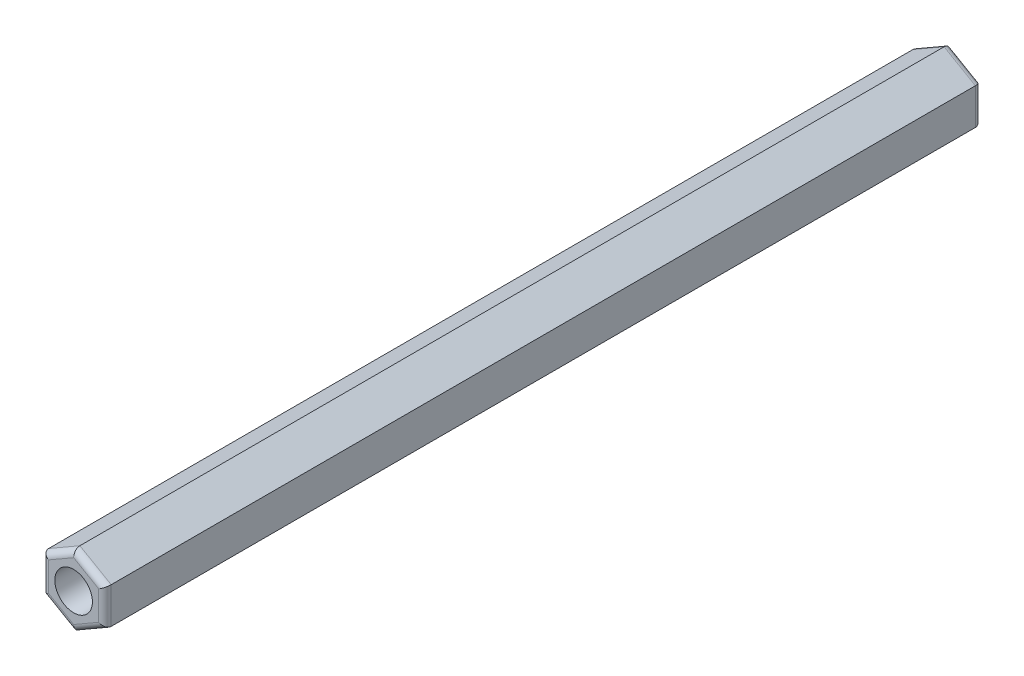
ISO-10303-21;
HEADER;
FILE_DESCRIPTION(('STEP AP214'),'2;1');
FILE_NAME('part.step','',(''),(''),'','','');
FILE_SCHEMA(('AUTOMOTIVE_DESIGN { 1 0 10303 214 1 1 1 1 }'));
ENDSEC;
DATA;
#1=APPLICATION_CONTEXT('core data for automotive mechanical design processes');
#2=APPLICATION_PROTOCOL_DEFINITION('international standard','automotive_design',2000,#1);
#3=PRODUCT_CONTEXT('',#1,'mechanical');
#4=PRODUCT('Part','Part','',(#3));
#5=PRODUCT_RELATED_PRODUCT_CATEGORY('part','',(#4));
#6=PRODUCT_DEFINITION_FORMATION('','',#4);
#7=PRODUCT_DEFINITION_CONTEXT('part definition',#1,'design');
#8=PRODUCT_DEFINITION('design','',#6,#7);
#9=PRODUCT_DEFINITION_SHAPE('','',#8);
#10=(LENGTH_UNIT() NAMED_UNIT(*) SI_UNIT(.MILLI.,.METRE.));
#11=(NAMED_UNIT(*) PLANE_ANGLE_UNIT() SI_UNIT($,.RADIAN.));
#12=(NAMED_UNIT(*) SI_UNIT($,.STERADIAN.) SOLID_ANGLE_UNIT());
#13=UNCERTAINTY_MEASURE_WITH_UNIT(LENGTH_MEASURE(1.E-05),#10,'distance_accuracy_value','');
#14=(GEOMETRIC_REPRESENTATION_CONTEXT(3) GLOBAL_UNCERTAINTY_ASSIGNED_CONTEXT((#13)) GLOBAL_UNIT_ASSIGNED_CONTEXT((#10,
#11,#12)) REPRESENTATION_CONTEXT('',''));
#15=CARTESIAN_POINT('',(0.,0.,0.));
#16=DIRECTION('',(0.,0.,1.));
#17=DIRECTION('',(1.,0.,0.));
#18=AXIS2_PLACEMENT_3D('',#15,#16,#17);
#19=CARTESIAN_POINT('',(-67.50212267549,1.44337567297406,70.));
#20=DIRECTION('',(1.,0.,0.));
#21=DIRECTION('',(0.,0.,-1.));
#22=AXIS2_PLACEMENT_3D('',#19,#20,#21);
#23=PLANE('',#22);
#24=DIRECTION('',(0.,0.,-1.));
#25=VECTOR('',#24,1.);
#26=CARTESIAN_POINT('',(-67.50212267549,-1.44337567297407,70.));
#27=LINE('',#26,#25);
#28=CARTESIAN_POINT('',(-67.50212267549,-1.44337567297407,69.5));
#29=VERTEX_POINT('',#28);
#30=CARTESIAN_POINT('',(-67.50212267549,-1.44337567297407,0.5));
#31=VERTEX_POINT('',#30);
#32=EDGE_CURVE('E153',#29,#31,#27,.T.);
#33=ORIENTED_EDGE('',*,*,#32,.T.);
#34=DIRECTION('',(0.,-1.,0.));
#35=VECTOR('',#34,1.);
#36=CARTESIAN_POINT('',(-67.50212267549,1.44337567297406,0.5));
#37=LINE('',#36,#35);
#38=CARTESIAN_POINT('',(-67.50212267549,1.44337567297406,0.5));
#39=VERTEX_POINT('',#38);
#40=EDGE_CURVE('E150',#31,#39,#37,.F.);
#41=ORIENTED_EDGE('',*,*,#40,.T.);
#42=DIRECTION('',(0.,0.,-1.));
#43=VECTOR('',#42,1.);
#44=CARTESIAN_POINT('',(-67.50212267549,1.44337567297406,70.));
#45=LINE('',#44,#43);
#46=CARTESIAN_POINT('',(-67.50212267549,1.44337567297406,69.5));
#47=VERTEX_POINT('',#46);
#48=EDGE_CURVE('E147',#47,#39,#45,.T.);
#49=ORIENTED_EDGE('',*,*,#48,.F.);
#50=DIRECTION('',(0.,-1.,0.));
#51=VECTOR('',#50,1.);
#52=CARTESIAN_POINT('',(-67.50212267549,-1.44337567297407,69.5));
#53=LINE('',#52,#51);
#54=EDGE_CURVE('E207',#47,#29,#53,.T.);
#55=ORIENTED_EDGE('',*,*,#54,.T.);
#56=EDGE_LOOP('',(#33,#41,#49,#55));
#57=FACE_BOUND('',#56,.T.);
#58=ADVANCED_FACE('F33',(#57),#23,.T.);
#59=CARTESIAN_POINT('',(-70.00212267549,2.88675134594811,70.));
#60=DIRECTION('',(0.5,0.866025403784439,0.));
#61=DIRECTION('',(-0.866025403784439,0.5,0.));
#62=AXIS2_PLACEMENT_3D('',#59,#60,#61);
#63=PLANE('',#62);
#64=ORIENTED_EDGE('',*,*,#48,.T.);
#65=DIRECTION('',(0.866025403784439,-0.5,0.));
#66=VECTOR('',#65,1.);
#67=CARTESIAN_POINT('',(-70.00212267549,2.88675134594811,0.5));
#68=LINE('',#67,#66);
#69=CARTESIAN_POINT('',(-70.00212267549,2.88675134594811,0.5));
#70=VERTEX_POINT('',#69);
#71=EDGE_CURVE('E192',#39,#70,#68,.F.);
#72=ORIENTED_EDGE('',*,*,#71,.T.);
#73=DIRECTION('',(0.,0.,-1.));
#74=VECTOR('',#73,1.);
#75=CARTESIAN_POINT('',(-70.00212267549,2.88675134594811,70.));
#76=LINE('',#75,#74);
#77=CARTESIAN_POINT('',(-70.00212267549,2.88675134594811,69.5));
#78=VERTEX_POINT('',#77);
#79=EDGE_CURVE('E256',#78,#70,#76,.T.);
#80=ORIENTED_EDGE('',*,*,#79,.F.);
#81=DIRECTION('',(0.866025403784439,-0.5,0.));
#82=VECTOR('',#81,1.);
#83=CARTESIAN_POINT('',(-67.50212267549,1.44337567297406,69.5));
#84=LINE('',#83,#82);
#85=EDGE_CURVE('E198',#78,#47,#84,.T.);
#86=ORIENTED_EDGE('',*,*,#85,.T.);
#87=EDGE_LOOP('',(#64,#72,#80,#86));
#88=FACE_BOUND('',#87,.T.);
#89=ADVANCED_FACE('F285',(#88),#63,.T.);
#90=CARTESIAN_POINT('',(-72.50212267549,1.44337567297405,70.));
#91=DIRECTION('',(-0.5,0.866025403784438,0.));
#92=DIRECTION('',(-0.866025403784439,-0.5,0.));
#93=AXIS2_PLACEMENT_3D('',#90,#91,#92);
#94=PLANE('',#93);
#95=ORIENTED_EDGE('',*,*,#79,.T.);
#96=DIRECTION('',(0.866025403784439,0.5,0.));
#97=VECTOR('',#96,1.);
#98=CARTESIAN_POINT('',(-72.50212267549,1.44337567297405,0.5));
#99=LINE('',#98,#97);
#100=CARTESIAN_POINT('',(-72.50212267549,1.44337567297405,0.5));
#101=VERTEX_POINT('',#100);
#102=EDGE_CURVE('E232',#70,#101,#99,.F.);
#103=ORIENTED_EDGE('',*,*,#102,.T.);
#104=DIRECTION('',(0.,0.,-1.));
#105=VECTOR('',#104,1.);
#106=CARTESIAN_POINT('',(-72.50212267549,1.44337567297405,70.));
#107=LINE('',#106,#105);
#108=CARTESIAN_POINT('',(-72.50212267549,1.44337567297405,69.5));
#109=VERTEX_POINT('',#108);
#110=EDGE_CURVE('E254',#109,#101,#107,.T.);
#111=ORIENTED_EDGE('',*,*,#110,.F.);
#112=DIRECTION('',(0.866025403784439,0.5,0.));
#113=VECTOR('',#112,1.);
#114=CARTESIAN_POINT('',(-70.00212267549,2.88675134594811,69.5));
#115=LINE('',#114,#113);
#116=EDGE_CURVE('E235',#109,#78,#115,.T.);
#117=ORIENTED_EDGE('',*,*,#116,.T.);
#118=EDGE_LOOP('',(#95,#103,#111,#117));
#119=FACE_BOUND('',#118,.T.);
#120=ADVANCED_FACE('F291',(#119),#94,.T.);
#121=CARTESIAN_POINT('',(-72.50212267549,-1.44337567297407,70.));
#122=DIRECTION('',(-1.,0.,0.));
#123=DIRECTION('',(0.,0.,1.));
#124=AXIS2_PLACEMENT_3D('',#121,#122,#123);
#125=PLANE('',#124);
#126=ORIENTED_EDGE('',*,*,#110,.T.);
#127=DIRECTION('',(0.,1.,0.));
#128=VECTOR('',#127,1.);
#129=CARTESIAN_POINT('',(-72.50212267549,-1.44337567297407,0.5));
#130=LINE('',#129,#128);
#131=CARTESIAN_POINT('',(-72.50212267549,-1.44337567297407,0.5));
#132=VERTEX_POINT('',#131);
#133=EDGE_CURVE('E202',#101,#132,#130,.F.);
#134=ORIENTED_EDGE('',*,*,#133,.T.);
#135=DIRECTION('',(0.,0.,-1.));
#136=VECTOR('',#135,1.);
#137=CARTESIAN_POINT('',(-72.50212267549,-1.44337567297407,70.));
#138=LINE('',#137,#136);
#139=CARTESIAN_POINT('',(-72.50212267549,-1.44337567297407,69.5));
#140=VERTEX_POINT('',#139);
#141=EDGE_CURVE('E251',#140,#132,#138,.T.);
#142=ORIENTED_EDGE('',*,*,#141,.F.);
#143=DIRECTION('',(0.,1.,0.));
#144=VECTOR('',#143,1.);
#145=CARTESIAN_POINT('',(-72.50212267549,1.44337567297405,69.5));
#146=LINE('',#145,#144);
#147=EDGE_CURVE('E227',#140,#109,#146,.T.);
#148=ORIENTED_EDGE('',*,*,#147,.T.);
#149=EDGE_LOOP('',(#126,#134,#142,#148));
#150=FACE_BOUND('',#149,.T.);
#151=ADVANCED_FACE('F342',(#150),#125,.T.);
#152=CARTESIAN_POINT('',(-70.00212267549,-2.88675134594813,70.));
#153=DIRECTION('',(-0.499999999999999,-0.866025403784439,0.));
#154=DIRECTION('',(0.866025403784439,-0.499999999999999,0.));
#155=AXIS2_PLACEMENT_3D('',#152,#153,#154);
#156=PLANE('',#155);
#157=ORIENTED_EDGE('',*,*,#141,.T.);
#158=DIRECTION('',(-0.866025403784439,0.499999999999999,0.));
#159=VECTOR('',#158,1.);
#160=CARTESIAN_POINT('',(-70.00212267549,-2.88675134594813,0.5));
#161=LINE('',#160,#159);
#162=CARTESIAN_POINT('',(-70.00212267549,-2.88675134594813,0.5));
#163=VERTEX_POINT('',#162);
#164=EDGE_CURVE('E200',#132,#163,#161,.F.);
#165=ORIENTED_EDGE('',*,*,#164,.T.);
#166=DIRECTION('',(0.,0.,-1.));
#167=VECTOR('',#166,1.);
#168=CARTESIAN_POINT('',(-70.00212267549,-2.88675134594813,70.));
#169=LINE('',#168,#167);
#170=CARTESIAN_POINT('',(-70.00212267549,-2.88675134594813,69.5));
#171=VERTEX_POINT('',#170);
#172=EDGE_CURVE('E248',#171,#163,#169,.T.);
#173=ORIENTED_EDGE('',*,*,#172,.F.);
#174=DIRECTION('',(-0.866025403784439,0.499999999999999,0.));
#175=VECTOR('',#174,1.);
#176=CARTESIAN_POINT('',(-72.50212267549,-1.44337567297407,69.5));
#177=LINE('',#176,#175);
#178=EDGE_CURVE('E197',#171,#140,#177,.T.);
#179=ORIENTED_EDGE('',*,*,#178,.T.);
#180=EDGE_LOOP('',(#157,#165,#173,#179));
#181=FACE_BOUND('',#180,.T.);
#182=ADVANCED_FACE('F281',(#181),#156,.T.);
#183=CARTESIAN_POINT('',(-67.50212267549,-1.44337567297407,70.));
#184=DIRECTION('',(0.500000000000001,-0.866025403784438,0.));
#185=DIRECTION('',(0.866025403784438,0.500000000000001,0.));
#186=AXIS2_PLACEMENT_3D('',#183,#184,#185);
#187=PLANE('',#186);
#188=ORIENTED_EDGE('',*,*,#172,.T.);
#189=DIRECTION('',(-0.866025403784438,-0.500000000000001,0.));
#190=VECTOR('',#189,1.);
#191=CARTESIAN_POINT('',(-67.50212267549,-1.44337567297407,0.5));
#192=LINE('',#191,#190);
#193=EDGE_CURVE('E212',#163,#31,#192,.F.);
#194=ORIENTED_EDGE('',*,*,#193,.T.);
#195=ORIENTED_EDGE('',*,*,#32,.F.);
#196=DIRECTION('',(-0.866025403784438,-0.500000000000001,0.));
#197=VECTOR('',#196,1.);
#198=CARTESIAN_POINT('',(-70.00212267549,-2.88675134594813,69.5));
#199=LINE('',#198,#197);
#200=EDGE_CURVE('E210',#29,#171,#199,.T.);
#201=ORIENTED_EDGE('',*,*,#200,.T.);
#202=EDGE_LOOP('',(#188,#194,#195,#201));
#203=FACE_BOUND('',#202,.T.);
#204=ADVANCED_FACE('F274',(#203),#187,.T.);
#205=CARTESIAN_POINT('',(0.,0.,70.));
#206=DIRECTION('',(0.,0.,-1.));
#207=DIRECTION('',(-1.,0.,0.));
#208=AXIS2_PLACEMENT_3D('',#205,#206,#207);
#209=PLANE('',#208);
#210=CARTESIAN_POINT('',(-70.00212267549,0.,70.));
#211=DIRECTION('',(0.,0.,1.));
#212=DIRECTION('',(1.,0.,0.));
#213=AXIS2_PLACEMENT_3D('',#210,#211,#212);
#214=CIRCLE('',#213,1.5);
#215=CARTESIAN_POINT('',(-68.50212267549,0.,70.));
#216=VERTEX_POINT('',#215);
#217=EDGE_CURVE('E259',#216,#216,#214,.T.);
#218=ORIENTED_EDGE('',*,*,#217,.F.);
#219=EDGE_LOOP('',(#218));
#220=FACE_BOUND('',#219,.T.);
#221=DIRECTION('',(0.866025403784439,-0.5,0.));
#222=VECTOR('',#221,1.);
#223=CARTESIAN_POINT('',(-70.25212267549,2.45373864405589,70.));
#224=LINE('',#223,#222);
#225=CARTESIAN_POINT('',(-68.00212267549,1.15470053837924,70.));
#226=VERTEX_POINT('',#225);
#227=CARTESIAN_POINT('',(-70.00212267549,2.30940107675849,70.));
#228=VERTEX_POINT('',#227);
#229=EDGE_CURVE('E57',#226,#228,#224,.F.);
#230=ORIENTED_EDGE('',*,*,#229,.T.);
#231=DIRECTION('',(0.866025403784439,0.5,0.));
#232=VECTOR('',#231,1.);
#233=CARTESIAN_POINT('',(-72.25212267549,1.01036297108183,70.));
#234=LINE('',#233,#232);
#235=CARTESIAN_POINT('',(-72.00212267549,1.15470053837923,70.));
#236=VERTEX_POINT('',#235);
#237=EDGE_CURVE('E11',#228,#236,#234,.F.);
#238=ORIENTED_EDGE('',*,*,#237,.T.);
#239=DIRECTION('',(0.,1.,0.));
#240=VECTOR('',#239,1.);
#241=CARTESIAN_POINT('',(-72.00212267549,-1.44337567297407,70.));
#242=LINE('',#241,#240);
#243=CARTESIAN_POINT('',(-72.00212267549,-1.15470053837925,70.));
#244=VERTEX_POINT('',#243);
#245=EDGE_CURVE('E42',#236,#244,#242,.F.);
#246=ORIENTED_EDGE('',*,*,#245,.T.);
#247=DIRECTION('',(-0.866025403784439,0.499999999999999,0.));
#248=VECTOR('',#247,1.);
#249=CARTESIAN_POINT('',(-69.75212267549,-2.45373864405591,70.));
#250=LINE('',#249,#248);
#251=CARTESIAN_POINT('',(-70.00212267549,-2.3094010767585,70.));
#252=VERTEX_POINT('',#251);
#253=EDGE_CURVE('E218',#244,#252,#250,.F.);
#254=ORIENTED_EDGE('',*,*,#253,.T.);
#255=DIRECTION('',(-0.866025403784438,-0.500000000000001,0.));
#256=VECTOR('',#255,1.);
#257=CARTESIAN_POINT('',(-67.75212267549,-1.01036297108185,70.));
#258=LINE('',#257,#256);
#259=CARTESIAN_POINT('',(-68.00212267549,-1.15470053837926,70.));
#260=VERTEX_POINT('',#259);
#261=EDGE_CURVE('E214',#252,#260,#258,.F.);
#262=ORIENTED_EDGE('',*,*,#261,.T.);
#263=DIRECTION('',(0.,-1.,0.));
#264=VECTOR('',#263,1.);
#265=CARTESIAN_POINT('',(-68.00212267549,1.44337567297406,70.));
#266=LINE('',#265,#264);
#267=EDGE_CURVE('E216',#260,#226,#266,.F.);
#268=ORIENTED_EDGE('',*,*,#267,.T.);
#269=EDGE_LOOP('',(#230,#238,#246,#254,#262,#268));
#270=FACE_BOUND('',#269,.T.);
#271=ADVANCED_FACE('F220',(#220,#270),#209,.F.);
#272=CARTESIAN_POINT('',(0.,0.,0.));
#273=DIRECTION('',(0.,0.,-1.));
#274=DIRECTION('',(-1.,0.,0.));
#275=AXIS2_PLACEMENT_3D('',#272,#273,#274);
#276=PLANE('',#275);
#277=CARTESIAN_POINT('',(-70.00212267549,0.,0.));
#278=DIRECTION('',(0.,0.,1.));
#279=DIRECTION('',(1.,0.,0.));
#280=AXIS2_PLACEMENT_3D('',#277,#278,#279);
#281=CIRCLE('',#280,1.5);
#282=CARTESIAN_POINT('',(-68.50212267549,0.,0.));
#283=VERTEX_POINT('',#282);
#284=EDGE_CURVE('E162',#283,#283,#281,.T.);
#285=ORIENTED_EDGE('',*,*,#284,.T.);
#286=EDGE_LOOP('',(#285));
#287=FACE_BOUND('',#286,.T.);
#288=DIRECTION('',(0.,1.,0.));
#289=VECTOR('',#288,1.);
#290=CARTESIAN_POINT('',(-72.00212267549,0.,0.));
#291=LINE('',#290,#289);
#292=CARTESIAN_POINT('',(-72.00212267549,-1.15470053837925,0.));
#293=VERTEX_POINT('',#292);
#294=CARTESIAN_POINT('',(-72.00212267549,1.15470053837924,0.));
#295=VERTEX_POINT('',#294);
#296=EDGE_CURVE('E242',#293,#295,#291,.T.);
#297=ORIENTED_EDGE('',*,*,#296,.T.);
#298=DIRECTION('',(0.866025403784439,0.5,0.));
#299=VECTOR('',#298,1.);
#300=CARTESIAN_POINT('',(-18.5005306688725,32.0438590854734,0.));
#301=LINE('',#300,#299);
#302=CARTESIAN_POINT('',(-70.00212267549,2.30940107675849,0.));
#303=VERTEX_POINT('',#302);
#304=EDGE_CURVE('E240',#295,#303,#301,.T.);
#305=ORIENTED_EDGE('',*,*,#304,.T.);
#306=DIRECTION('',(0.866025403784439,-0.5,0.));
#307=VECTOR('',#306,1.);
#308=CARTESIAN_POINT('',(-16.5005306688725,-28.5797574703356,0.));
#309=LINE('',#308,#307);
#310=CARTESIAN_POINT('',(-68.00212267549,1.15470053837924,0.));
#311=VERTEX_POINT('',#310);
#312=EDGE_CURVE('E131',#303,#311,#309,.T.);
#313=ORIENTED_EDGE('',*,*,#312,.T.);
#314=DIRECTION('',(0.,-1.,0.));
#315=VECTOR('',#314,1.);
#316=CARTESIAN_POINT('',(-68.00212267549,0.,0.));
#317=LINE('',#316,#315);
#318=CARTESIAN_POINT('',(-68.00212267549,-1.15470053837925,0.));
#319=VERTEX_POINT('',#318);
#320=EDGE_CURVE('E124',#311,#319,#317,.T.);
#321=ORIENTED_EDGE('',*,*,#320,.T.);
#322=DIRECTION('',(-0.866025403784438,-0.500000000000001,0.));
#323=VECTOR('',#322,1.);
#324=CARTESIAN_POINT('',(-16.5005306688726,28.5797574703357,0.));
#325=LINE('',#324,#323);
#326=CARTESIAN_POINT('',(-70.00212267549,-2.3094010767585,0.));
#327=VERTEX_POINT('',#326);
#328=EDGE_CURVE('E127',#319,#327,#325,.T.);
#329=ORIENTED_EDGE('',*,*,#328,.T.);
#330=DIRECTION('',(-0.866025403784439,0.499999999999999,0.));
#331=VECTOR('',#330,1.);
#332=CARTESIAN_POINT('',(-18.5005306688724,-32.0438590854734,0.));
#333=LINE('',#332,#331);
#334=EDGE_CURVE('E136',#327,#293,#333,.T.);
#335=ORIENTED_EDGE('',*,*,#334,.T.);
#336=EDGE_LOOP('',(#297,#305,#313,#321,#329,#335));
#337=FACE_BOUND('',#336,.T.);
#338=ADVANCED_FACE('F126',(#287,#337),#276,.T.);
#339=CARTESIAN_POINT('',(-16.5005306688726,28.5797574703357,0.5));
#340=DIRECTION('',(-0.866025403784438,-0.500000000000001,0.));
#341=DIRECTION('',(0.500000000000001,-0.866025403784438,0.));
#342=AXIS2_PLACEMENT_3D('',#339,#340,#341);
#343=CYLINDRICAL_SURFACE('',#342,0.5);
#344=CARTESIAN_POINT('',(-68.00212267549,-1.15470053837925,0.5));
#345=DIRECTION('',(-0.5,-0.866025403784439,0.));
#346=DIRECTION('',(-0.866025403784439,0.5,0.));
#347=AXIS2_PLACEMENT_3D('',#344,#345,#346);
#348=ELLIPSE('',#347,0.577350269189626,0.5);
#349=EDGE_CURVE('E142',#31,#319,#348,.F.);
#350=ORIENTED_EDGE('',*,*,#349,.F.);
#351=ORIENTED_EDGE('',*,*,#193,.F.);
#352=CARTESIAN_POINT('',(-70.00212267549,-2.30940107675849,0.5));
#353=DIRECTION('',(-1.,0.,0.));
#354=DIRECTION('',(0.,-1.,0.));
#355=AXIS2_PLACEMENT_3D('',#352,#353,#354);
#356=ELLIPSE('',#355,0.577350269189626,0.5);
#357=EDGE_CURVE('E145',#327,#163,#356,.T.);
#358=ORIENTED_EDGE('',*,*,#357,.F.);
#359=ORIENTED_EDGE('',*,*,#328,.F.);
#360=EDGE_LOOP('',(#350,#351,#358,#359));
#361=FACE_BOUND('',#360,.T.);
#362=ADVANCED_FACE('F140',(#361),#343,.T.);
#363=CARTESIAN_POINT('',(-18.5005306688724,-32.0438590854734,0.5));
#364=DIRECTION('',(-0.866025403784439,0.499999999999999,0.));
#365=DIRECTION('',(-0.499999999999999,-0.866025403784439,0.));
#366=AXIS2_PLACEMENT_3D('',#363,#364,#365);
#367=CYLINDRICAL_SURFACE('',#366,0.5);
#368=ORIENTED_EDGE('',*,*,#357,.T.);
#369=ORIENTED_EDGE('',*,*,#164,.F.);
#370=CARTESIAN_POINT('',(-72.00212267549,-1.15470053837925,0.5));
#371=DIRECTION('',(-0.500000000000001,0.866025403784438,0.));
#372=DIRECTION('',(-0.866025403784438,-0.500000000000001,0.));
#373=AXIS2_PLACEMENT_3D('',#370,#371,#372);
#374=ELLIPSE('',#373,0.577350269189626,0.5);
#375=EDGE_CURVE('E151',#293,#132,#374,.T.);
#376=ORIENTED_EDGE('',*,*,#375,.F.);
#377=ORIENTED_EDGE('',*,*,#334,.F.);
#378=EDGE_LOOP('',(#368,#369,#376,#377));
#379=FACE_BOUND('',#378,.T.);
#380=ADVANCED_FACE('F306',(#379),#367,.T.);
#381=CARTESIAN_POINT('',(-68.00212267549,0.,0.5));
#382=DIRECTION('',(0.,-1.,0.));
#383=DIRECTION('',(0.,0.,-1.));
#384=AXIS2_PLACEMENT_3D('',#381,#382,#383);
#385=CYLINDRICAL_SURFACE('',#384,0.5);
#386=ORIENTED_EDGE('',*,*,#349,.T.);
#387=ORIENTED_EDGE('',*,*,#320,.F.);
#388=CARTESIAN_POINT('',(-68.00212267549,1.15470053837925,0.5));
#389=DIRECTION('',(0.5,-0.866025403784439,0.));
#390=DIRECTION('',(-0.866025403784439,-0.5,0.));
#391=AXIS2_PLACEMENT_3D('',#388,#389,#390);
#392=ELLIPSE('',#391,0.577350269189626,0.5);
#393=EDGE_CURVE('E156',#39,#311,#392,.F.);
#394=ORIENTED_EDGE('',*,*,#393,.F.);
#395=ORIENTED_EDGE('',*,*,#40,.F.);
#396=EDGE_LOOP('',(#386,#387,#394,#395));
#397=FACE_BOUND('',#396,.T.);
#398=ADVANCED_FACE('F149',(#397),#385,.T.);
#399=CARTESIAN_POINT('',(-72.00212267549,0.,0.5));
#400=DIRECTION('',(0.,1.,0.));
#401=DIRECTION('',(0.,0.,1.));
#402=AXIS2_PLACEMENT_3D('',#399,#400,#401);
#403=CYLINDRICAL_SURFACE('',#402,0.5);
#404=ORIENTED_EDGE('',*,*,#375,.T.);
#405=ORIENTED_EDGE('',*,*,#133,.F.);
#406=CARTESIAN_POINT('',(-72.00212267549,1.15470053837923,0.5));
#407=DIRECTION('',(0.5,0.866025403784439,0.));
#408=DIRECTION('',(-0.866025403784439,0.5,0.));
#409=AXIS2_PLACEMENT_3D('',#406,#407,#408);
#410=ELLIPSE('',#409,0.577350269189626,0.5);
#411=EDGE_CURVE('E181',#295,#101,#410,.T.);
#412=ORIENTED_EDGE('',*,*,#411,.F.);
#413=ORIENTED_EDGE('',*,*,#296,.F.);
#414=EDGE_LOOP('',(#404,#405,#412,#413));
#415=FACE_BOUND('',#414,.T.);
#416=ADVANCED_FACE('F300',(#415),#403,.T.);
#417=CARTESIAN_POINT('',(-16.5005306688725,-28.5797574703356,0.5));
#418=DIRECTION('',(0.866025403784439,-0.5,0.));
#419=DIRECTION('',(0.5,0.866025403784439,0.));
#420=AXIS2_PLACEMENT_3D('',#417,#418,#419);
#421=CYLINDRICAL_SURFACE('',#420,0.5);
#422=ORIENTED_EDGE('',*,*,#393,.T.);
#423=ORIENTED_EDGE('',*,*,#312,.F.);
#424=CARTESIAN_POINT('',(-70.00212267549,2.30940107675848,0.5));
#425=DIRECTION('',(1.,0.,0.));
#426=DIRECTION('',(0.,-1.,0.));
#427=AXIS2_PLACEMENT_3D('',#424,#425,#426);
#428=ELLIPSE('',#427,0.577350269189626,0.5);
#429=EDGE_CURVE('E176',#70,#303,#428,.F.);
#430=ORIENTED_EDGE('',*,*,#429,.F.);
#431=ORIENTED_EDGE('',*,*,#71,.F.);
#432=EDGE_LOOP('',(#422,#423,#430,#431));
#433=FACE_BOUND('',#432,.T.);
#434=ADVANCED_FACE('F191',(#433),#421,.T.);
#435=CARTESIAN_POINT('',(-18.5005306688725,32.0438590854734,0.5));
#436=DIRECTION('',(0.866025403784439,0.5,0.));
#437=DIRECTION('',(-0.5,0.866025403784438,0.));
#438=AXIS2_PLACEMENT_3D('',#435,#436,#437);
#439=CYLINDRICAL_SURFACE('',#438,0.5);
#440=ORIENTED_EDGE('',*,*,#411,.T.);
#441=ORIENTED_EDGE('',*,*,#102,.F.);
#442=ORIENTED_EDGE('',*,*,#429,.T.);
#443=ORIENTED_EDGE('',*,*,#304,.F.);
#444=EDGE_LOOP('',(#440,#441,#442,#443));
#445=FACE_BOUND('',#444,.T.);
#446=ADVANCED_FACE('F295',(#445),#439,.T.);
#447=CARTESIAN_POINT('',(-67.75212267549,-1.01036297108185,69.5));
#448=DIRECTION('',(0.866025403784438,0.500000000000001,0.));
#449=DIRECTION('',(-0.500000000000001,0.866025403784438,0.));
#450=AXIS2_PLACEMENT_3D('',#447,#448,#449);
#451=CYLINDRICAL_SURFACE('',#450,0.5);
#452=CARTESIAN_POINT('',(-68.00212267549,-1.15470053837926,69.5));
#453=DIRECTION('',(0.5,0.866025403784439,0.));
#454=DIRECTION('',(0.866025403784439,-0.5,0.));
#455=AXIS2_PLACEMENT_3D('',#452,#453,#454);
#456=ELLIPSE('',#455,0.577350269189626,0.5);
#457=EDGE_CURVE('E169',#260,#29,#456,.T.);
#458=ORIENTED_EDGE('',*,*,#457,.F.);
#459=ORIENTED_EDGE('',*,*,#261,.F.);
#460=CARTESIAN_POINT('',(-70.00212267549,-2.3094010767585,69.5));
#461=DIRECTION('',(1.,0.,0.));
#462=DIRECTION('',(0.,1.,0.));
#463=AXIS2_PLACEMENT_3D('',#460,#461,#462);
#464=ELLIPSE('',#463,0.577350269189626,0.5);
#465=EDGE_CURVE('E37',#171,#252,#464,.F.);
#466=ORIENTED_EDGE('',*,*,#465,.F.);
#467=ORIENTED_EDGE('',*,*,#200,.F.);
#468=EDGE_LOOP('',(#458,#459,#466,#467));
#469=FACE_BOUND('',#468,.T.);
#470=ADVANCED_FACE('F35',(#469),#451,.T.);
#471=CARTESIAN_POINT('',(-69.75212267549,-2.45373864405591,69.5));
#472=DIRECTION('',(0.866025403784439,-0.499999999999999,0.));
#473=DIRECTION('',(0.499999999999999,0.866025403784439,0.));
#474=AXIS2_PLACEMENT_3D('',#471,#472,#473);
#475=CYLINDRICAL_SURFACE('',#474,0.5);
#476=ORIENTED_EDGE('',*,*,#465,.T.);
#477=ORIENTED_EDGE('',*,*,#253,.F.);
#478=CARTESIAN_POINT('',(-72.00212267549,-1.15470053837925,69.5));
#479=DIRECTION('',(0.500000000000001,-0.866025403784438,0.));
#480=DIRECTION('',(0.866025403784438,0.500000000000001,0.));
#481=AXIS2_PLACEMENT_3D('',#478,#479,#480);
#482=ELLIPSE('',#481,0.577350269189626,0.5);
#483=EDGE_CURVE('E167',#140,#244,#482,.F.);
#484=ORIENTED_EDGE('',*,*,#483,.F.);
#485=ORIENTED_EDGE('',*,*,#178,.F.);
#486=EDGE_LOOP('',(#476,#477,#484,#485));
#487=FACE_BOUND('',#486,.T.);
#488=ADVANCED_FACE('F224',(#487),#475,.T.);
#489=CARTESIAN_POINT('',(-68.00212267549,1.44337567297406,69.5));
#490=DIRECTION('',(0.,1.,0.));
#491=DIRECTION('',(0.,0.,1.));
#492=AXIS2_PLACEMENT_3D('',#489,#490,#491);
#493=CYLINDRICAL_SURFACE('',#492,0.5);
#494=ORIENTED_EDGE('',*,*,#457,.T.);
#495=ORIENTED_EDGE('',*,*,#54,.F.);
#496=CARTESIAN_POINT('',(-68.00212267549,1.15470053837924,69.5));
#497=DIRECTION('',(-0.5,0.866025403784439,0.));
#498=DIRECTION('',(0.866025403784439,0.5,0.));
#499=AXIS2_PLACEMENT_3D('',#496,#497,#498);
#500=ELLIPSE('',#499,0.577350269189626,0.5);
#501=EDGE_CURVE('E164',#226,#47,#500,.T.);
#502=ORIENTED_EDGE('',*,*,#501,.F.);
#503=ORIENTED_EDGE('',*,*,#267,.F.);
#504=EDGE_LOOP('',(#494,#495,#502,#503));
#505=FACE_BOUND('',#504,.T.);
#506=ADVANCED_FACE('F320',(#505),#493,.T.);
#507=CARTESIAN_POINT('',(-72.00212267549,-1.44337567297407,69.5));
#508=DIRECTION('',(0.,-1.,0.));
#509=DIRECTION('',(0.,0.,-1.));
#510=AXIS2_PLACEMENT_3D('',#507,#508,#509);
#511=CYLINDRICAL_SURFACE('',#510,0.5);
#512=ORIENTED_EDGE('',*,*,#483,.T.);
#513=ORIENTED_EDGE('',*,*,#245,.F.);
#514=CARTESIAN_POINT('',(-72.00212267549,1.15470053837923,69.5));
#515=DIRECTION('',(-0.5,-0.866025403784439,0.));
#516=DIRECTION('',(0.866025403784439,-0.5,0.));
#517=AXIS2_PLACEMENT_3D('',#514,#515,#516);
#518=ELLIPSE('',#517,0.577350269189626,0.5);
#519=EDGE_CURVE('E50',#109,#236,#518,.F.);
#520=ORIENTED_EDGE('',*,*,#519,.F.);
#521=ORIENTED_EDGE('',*,*,#147,.F.);
#522=EDGE_LOOP('',(#512,#513,#520,#521));
#523=FACE_BOUND('',#522,.T.);
#524=ADVANCED_FACE('F226',(#523),#511,.T.);
#525=CARTESIAN_POINT('',(-70.25212267549,2.45373864405589,69.5));
#526=DIRECTION('',(-0.866025403784439,0.5,0.));
#527=DIRECTION('',(-0.5,-0.866025403784439,0.));
#528=AXIS2_PLACEMENT_3D('',#525,#526,#527);
#529=CYLINDRICAL_SURFACE('',#528,0.5);
#530=ORIENTED_EDGE('',*,*,#501,.T.);
#531=ORIENTED_EDGE('',*,*,#85,.F.);
#532=CARTESIAN_POINT('',(-70.00212267549,2.30940107675849,69.5));
#533=DIRECTION('',(-1.,0.,0.));
#534=DIRECTION('',(0.,1.,0.));
#535=AXIS2_PLACEMENT_3D('',#532,#533,#534);
#536=ELLIPSE('',#535,0.577350269189626,0.5);
#537=EDGE_CURVE('E160',#228,#78,#536,.T.);
#538=ORIENTED_EDGE('',*,*,#537,.F.);
#539=ORIENTED_EDGE('',*,*,#229,.F.);
#540=EDGE_LOOP('',(#530,#531,#538,#539));
#541=FACE_BOUND('',#540,.T.);
#542=ADVANCED_FACE('F314',(#541),#529,.T.);
#543=CARTESIAN_POINT('',(-72.25212267549,1.01036297108183,69.5));
#544=DIRECTION('',(-0.866025403784439,-0.5,0.));
#545=DIRECTION('',(0.5,-0.866025403784438,0.));
#546=AXIS2_PLACEMENT_3D('',#543,#544,#545);
#547=CYLINDRICAL_SURFACE('',#546,0.5);
#548=ORIENTED_EDGE('',*,*,#519,.T.);
#549=ORIENTED_EDGE('',*,*,#237,.F.);
#550=ORIENTED_EDGE('',*,*,#537,.T.);
#551=ORIENTED_EDGE('',*,*,#116,.F.);
#552=EDGE_LOOP('',(#548,#549,#550,#551));
#553=FACE_BOUND('',#552,.T.);
#554=ADVANCED_FACE('F269',(#553),#547,.T.);
#555=CARTESIAN_POINT('',(-70.00212267549,0.,0.));
#556=DIRECTION('',(0.,0.,1.));
#557=DIRECTION('',(1.,0.,0.));
#558=AXIS2_PLACEMENT_3D('',#555,#556,#557);
#559=CYLINDRICAL_SURFACE('',#558,1.5);
#560=ORIENTED_EDGE('',*,*,#284,.F.);
#561=EDGE_LOOP('',(#560));
#562=FACE_BOUND('',#561,.T.);
#563=ORIENTED_EDGE('',*,*,#217,.T.);
#564=EDGE_LOOP('',(#563));
#565=FACE_BOUND('',#564,.T.);
#566=ADVANCED_FACE('F266',(#562,#565),#559,.F.);
#567=CLOSED_SHELL('',(#58,#89,#120,#151,#182,#204,#271,#338,#362,#380,#398,#416,#434,#446,#470,
#488,#506,#524,#542,#554,#566));
#568=MANIFOLD_SOLID_BREP('B2',#567);
#569=ADVANCED_BREP_SHAPE_REPRESENTATION('',(#18,#568),#14);
#570=SHAPE_DEFINITION_REPRESENTATION(#9,#569);
ENDSEC;
END-ISO-10303-21;
